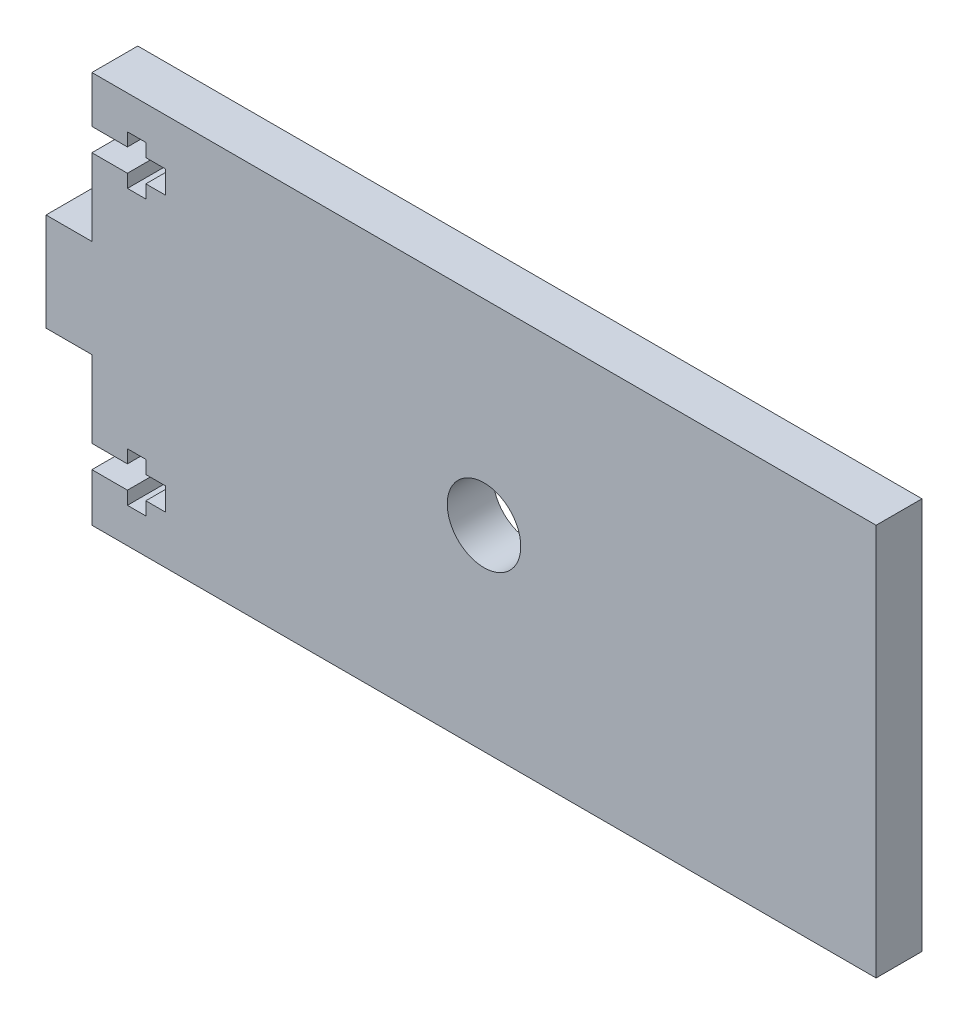
ISO-10303-21;
HEADER;
FILE_DESCRIPTION(('STEP AP214'),'2;1');
FILE_NAME('part.step','',(''),(''),'','','');
FILE_SCHEMA(('AUTOMOTIVE_DESIGN { 1 0 10303 214 1 1 1 1 }'));
ENDSEC;
DATA;
#1=APPLICATION_CONTEXT('core data for automotive mechanical design processes');
#2=APPLICATION_PROTOCOL_DEFINITION('international standard','automotive_design',2000,#1);
#3=PRODUCT_CONTEXT('',#1,'mechanical');
#4=PRODUCT('Part','Part','',(#3));
#5=PRODUCT_RELATED_PRODUCT_CATEGORY('part','',(#4));
#6=PRODUCT_DEFINITION_FORMATION('','',#4);
#7=PRODUCT_DEFINITION_CONTEXT('part definition',#1,'design');
#8=PRODUCT_DEFINITION('design','',#6,#7);
#9=PRODUCT_DEFINITION_SHAPE('','',#8);
#10=(LENGTH_UNIT() NAMED_UNIT(*) SI_UNIT(.MILLI.,.METRE.));
#11=(NAMED_UNIT(*) PLANE_ANGLE_UNIT() SI_UNIT($,.RADIAN.));
#12=(NAMED_UNIT(*) SI_UNIT($,.STERADIAN.) SOLID_ANGLE_UNIT());
#13=UNCERTAINTY_MEASURE_WITH_UNIT(LENGTH_MEASURE(1.E-05),#10,'distance_accuracy_value','');
#14=(GEOMETRIC_REPRESENTATION_CONTEXT(3) GLOBAL_UNCERTAINTY_ASSIGNED_CONTEXT((#13)) GLOBAL_UNIT_ASSIGNED_CONTEXT((#10,
#11,#12)) REPRESENTATION_CONTEXT('',''));
#15=CARTESIAN_POINT('',(0.,0.,0.));
#16=DIRECTION('',(0.,0.,1.));
#17=DIRECTION('',(1.,0.,0.));
#18=AXIS2_PLACEMENT_3D('',#15,#16,#17);
#19=CARTESIAN_POINT('',(0.,0.,5.9436));
#20=DIRECTION('',(1.,0.,0.));
#21=DIRECTION('',(0.,0.,-1.));
#22=AXIS2_PLACEMENT_3D('',#19,#20,#21);
#23=PLANE('',#22);
#24=DIRECTION('',(0.,-1.,0.));
#25=VECTOR('',#24,1.);
#26=CARTESIAN_POINT('',(0.,0.,5.9436));
#27=LINE('',#26,#25);
#28=CARTESIAN_POINT('',(0.,41.798931347115,5.9436));
#29=VERTEX_POINT('',#28);
#30=CARTESIAN_POINT('',(0.,31.842131347115,5.9436));
#31=VERTEX_POINT('',#30);
#32=EDGE_CURVE('E267',#29,#31,#27,.T.);
#33=ORIENTED_EDGE('',*,*,#32,.F.);
#34=DIRECTION('',(0.,0.,-1.));
#35=VECTOR('',#34,1.);
#36=CARTESIAN_POINT('',(0.,41.798931347115,5.9436));
#37=LINE('',#36,#35);
#38=CARTESIAN_POINT('',(0.,41.798931347115,0.));
#39=VERTEX_POINT('',#38);
#40=EDGE_CURVE('E317',#29,#39,#37,.T.);
#41=ORIENTED_EDGE('',*,*,#40,.T.);
#42=DIRECTION('',(0.,-1.,0.));
#43=VECTOR('',#42,1.);
#44=CARTESIAN_POINT('',(0.,0.,0.));
#45=LINE('',#44,#43);
#46=CARTESIAN_POINT('',(0.,31.842131347115,0.));
#47=VERTEX_POINT('',#46);
#48=EDGE_CURVE('E390',#39,#47,#45,.T.);
#49=ORIENTED_EDGE('',*,*,#48,.T.);
#50=DIRECTION('',(0.,0.,-1.));
#51=VECTOR('',#50,1.);
#52=CARTESIAN_POINT('',(0.,31.842131347115,19.9654861197629));
#53=LINE('',#52,#51);
#54=EDGE_CURVE('E311',#31,#47,#53,.T.);
#55=ORIENTED_EDGE('',*,*,#54,.F.);
#56=EDGE_LOOP('',(#33,#41,#49,#55));
#57=FACE_BOUND('',#56,.T.);
#58=ADVANCED_FACE('F32',(#57),#23,.F.);
#59=CARTESIAN_POINT('',(0.,19.142131347115,0.));
#60=VERTEX_POINT('',#59);
#61=CARTESIAN_POINT('',(0.,9.18533134711462,0.));
#62=VERTEX_POINT('',#61);
#63=EDGE_CURVE('E290',#60,#62,#45,.T.);
#64=ORIENTED_EDGE('',*,*,#63,.T.);
#65=DIRECTION('',(0.,0.,-1.));
#66=VECTOR('',#65,1.);
#67=CARTESIAN_POINT('',(0.,9.18533134711462,5.9436));
#68=LINE('',#67,#66);
#69=CARTESIAN_POINT('',(0.,9.18533134711462,5.9436));
#70=VERTEX_POINT('',#69);
#71=EDGE_CURVE('E289',#70,#62,#68,.T.);
#72=ORIENTED_EDGE('',*,*,#71,.F.);
#73=CARTESIAN_POINT('',(0.,19.142131347115,5.9436));
#74=VERTEX_POINT('',#73);
#75=EDGE_CURVE('E270',#74,#70,#27,.T.);
#76=ORIENTED_EDGE('',*,*,#75,.F.);
#77=DIRECTION('',(0.,0.,-1.));
#78=VECTOR('',#77,1.);
#79=CARTESIAN_POINT('',(0.,19.142131347115,19.9654861197629));
#80=LINE('',#79,#78);
#81=EDGE_CURVE('E287',#74,#60,#80,.T.);
#82=ORIENTED_EDGE('',*,*,#81,.T.);
#83=EDGE_LOOP('',(#64,#72,#76,#82));
#84=FACE_BOUND('',#83,.T.);
#85=ADVANCED_FACE('F286',(#84),#23,.F.);
#86=CARTESIAN_POINT('',(0.,50.8,0.));
#87=VERTEX_POINT('',#86);
#88=CARTESIAN_POINT('',(0.,44.745331347115,0.));
#89=VERTEX_POINT('',#88);
#90=EDGE_CURVE('E257',#87,#89,#45,.T.);
#91=ORIENTED_EDGE('',*,*,#90,.T.);
#92=DIRECTION('',(0.,0.,-1.));
#93=VECTOR('',#92,1.);
#94=CARTESIAN_POINT('',(0.,44.745331347115,5.9436));
#95=LINE('',#94,#93);
#96=CARTESIAN_POINT('',(0.,44.745331347115,5.9436));
#97=VERTEX_POINT('',#96);
#98=EDGE_CURVE('E55',#97,#89,#95,.T.);
#99=ORIENTED_EDGE('',*,*,#98,.F.);
#100=CARTESIAN_POINT('',(0.,50.8,5.9436));
#101=VERTEX_POINT('',#100);
#102=EDGE_CURVE('E255',#101,#97,#27,.T.);
#103=ORIENTED_EDGE('',*,*,#102,.F.);
#104=DIRECTION('',(0.,0.,-1.));
#105=VECTOR('',#104,1.);
#106=CARTESIAN_POINT('',(0.,50.8,5.9436));
#107=LINE('',#106,#105);
#108=EDGE_CURVE('E386',#101,#87,#107,.T.);
#109=ORIENTED_EDGE('',*,*,#108,.T.);
#110=EDGE_LOOP('',(#91,#99,#103,#109));
#111=FACE_BOUND('',#110,.T.);
#112=ADVANCED_FACE('F253',(#111),#23,.F.);
#113=CARTESIAN_POINT('',(0.,6.23893134711462,5.9436));
#114=VERTEX_POINT('',#113);
#115=CARTESIAN_POINT('',(0.,0.,5.9436));
#116=VERTEX_POINT('',#115);
#117=EDGE_CURVE('E269',#114,#116,#27,.T.);
#118=ORIENTED_EDGE('',*,*,#117,.F.);
#119=DIRECTION('',(0.,0.,-1.));
#120=VECTOR('',#119,1.);
#121=CARTESIAN_POINT('',(0.,6.23893134711462,5.9436));
#122=LINE('',#121,#120);
#123=CARTESIAN_POINT('',(0.,6.23893134711462,0.));
#124=VERTEX_POINT('',#123);
#125=EDGE_CURVE('E295',#114,#124,#122,.T.);
#126=ORIENTED_EDGE('',*,*,#125,.T.);
#127=CARTESIAN_POINT('',(0.,0.,0.));
#128=VERTEX_POINT('',#127);
#129=EDGE_CURVE('E334',#124,#128,#45,.T.);
#130=ORIENTED_EDGE('',*,*,#129,.T.);
#131=DIRECTION('',(0.,0.,-1.));
#132=VECTOR('',#131,1.);
#133=CARTESIAN_POINT('',(0.,0.,5.9436));
#134=LINE('',#133,#132);
#135=EDGE_CURVE('E11',#116,#128,#134,.T.);
#136=ORIENTED_EDGE('',*,*,#135,.F.);
#137=EDGE_LOOP('',(#118,#126,#130,#136));
#138=FACE_BOUND('',#137,.T.);
#139=ADVANCED_FACE('F34',(#138),#23,.F.);
#140=CARTESIAN_POINT('',(0.,0.,5.9436));
#141=DIRECTION('',(0.,1.,0.));
#142=DIRECTION('',(0.,0.,1.));
#143=AXIS2_PLACEMENT_3D('',#140,#141,#142);
#144=PLANE('',#143);
#145=DIRECTION('',(1.,0.,0.));
#146=VECTOR('',#145,1.);
#147=CARTESIAN_POINT('',(0.,0.,0.));
#148=LINE('',#147,#146);
#149=CARTESIAN_POINT('',(101.6,0.,0.));
#150=VERTEX_POINT('',#149);
#151=EDGE_CURVE('E379',#128,#150,#148,.T.);
#152=ORIENTED_EDGE('',*,*,#151,.T.);
#153=DIRECTION('',(0.,0.,-1.));
#154=VECTOR('',#153,1.);
#155=CARTESIAN_POINT('',(101.6,0.,5.9436));
#156=LINE('',#155,#154);
#157=CARTESIAN_POINT('',(101.6,0.,5.9436));
#158=VERTEX_POINT('',#157);
#159=EDGE_CURVE('E40',#158,#150,#156,.T.);
#160=ORIENTED_EDGE('',*,*,#159,.F.);
#161=DIRECTION('',(1.,0.,0.));
#162=VECTOR('',#161,1.);
#163=CARTESIAN_POINT('',(0.,0.,5.9436));
#164=LINE('',#163,#162);
#165=EDGE_CURVE('E266',#116,#158,#164,.T.);
#166=ORIENTED_EDGE('',*,*,#165,.F.);
#167=ORIENTED_EDGE('',*,*,#135,.T.);
#168=EDGE_LOOP('',(#152,#160,#166,#167));
#169=FACE_BOUND('',#168,.T.);
#170=ADVANCED_FACE('F360',(#169),#144,.F.);
#171=CARTESIAN_POINT('',(101.6,0.,5.9436));
#172=DIRECTION('',(-1.,0.,0.));
#173=DIRECTION('',(0.,0.,1.));
#174=AXIS2_PLACEMENT_3D('',#171,#172,#173);
#175=PLANE('',#174);
#176=DIRECTION('',(0.,1.,0.));
#177=VECTOR('',#176,1.);
#178=CARTESIAN_POINT('',(101.6,0.,0.));
#179=LINE('',#178,#177);
#180=CARTESIAN_POINT('',(101.6,50.8,0.));
#181=VERTEX_POINT('',#180);
#182=EDGE_CURVE('E392',#150,#181,#179,.T.);
#183=ORIENTED_EDGE('',*,*,#182,.T.);
#184=DIRECTION('',(0.,0.,-1.));
#185=VECTOR('',#184,1.);
#186=CARTESIAN_POINT('',(101.6,50.8,5.9436));
#187=LINE('',#186,#185);
#188=CARTESIAN_POINT('',(101.6,50.8,5.9436));
#189=VERTEX_POINT('',#188);
#190=EDGE_CURVE('E382',#189,#181,#187,.T.);
#191=ORIENTED_EDGE('',*,*,#190,.F.);
#192=DIRECTION('',(0.,1.,0.));
#193=VECTOR('',#192,1.);
#194=CARTESIAN_POINT('',(101.6,0.,5.9436));
#195=LINE('',#194,#193);
#196=EDGE_CURVE('E271',#158,#189,#195,.T.);
#197=ORIENTED_EDGE('',*,*,#196,.F.);
#198=ORIENTED_EDGE('',*,*,#159,.T.);
#199=EDGE_LOOP('',(#183,#191,#197,#198));
#200=FACE_BOUND('',#199,.T.);
#201=ADVANCED_FACE('F349',(#200),#175,.F.);
#202=CARTESIAN_POINT('',(0.,50.8,5.9436));
#203=DIRECTION('',(0.,-1.,0.));
#204=DIRECTION('',(0.,0.,-1.));
#205=AXIS2_PLACEMENT_3D('',#202,#203,#204);
#206=PLANE('',#205);
#207=DIRECTION('',(-1.,0.,0.));
#208=VECTOR('',#207,1.);
#209=CARTESIAN_POINT('',(0.,50.8,0.));
#210=LINE('',#209,#208);
#211=EDGE_CURVE('E274',#181,#87,#210,.T.);
#212=ORIENTED_EDGE('',*,*,#211,.T.);
#213=ORIENTED_EDGE('',*,*,#108,.F.);
#214=DIRECTION('',(-1.,0.,0.));
#215=VECTOR('',#214,1.);
#216=CARTESIAN_POINT('',(0.,50.8,5.9436));
#217=LINE('',#216,#215);
#218=EDGE_CURVE('E264',#189,#101,#217,.T.);
#219=ORIENTED_EDGE('',*,*,#218,.F.);
#220=ORIENTED_EDGE('',*,*,#190,.T.);
#221=EDGE_LOOP('',(#212,#213,#219,#220));
#222=FACE_BOUND('',#221,.T.);
#223=ADVANCED_FACE('F341',(#222),#206,.F.);
#224=CARTESIAN_POINT('',(0.,0.,5.9436));
#225=DIRECTION('',(0.,0.,-1.));
#226=DIRECTION('',(-1.,0.,0.));
#227=AXIS2_PLACEMENT_3D('',#224,#225,#226);
#228=PLANE('',#227);
#229=DIRECTION('',(0.,1.,0.));
#230=VECTOR('',#229,1.);
#231=CARTESIAN_POINT('',(4.60401,41.7989313471151,5.9436));
#232=LINE('',#231,#230);
#233=CARTESIAN_POINT('',(4.60401,40.0971313471151,5.9436));
#234=VERTEX_POINT('',#233);
#235=CARTESIAN_POINT('',(4.60401,41.7989313471151,5.9436));
#236=VERTEX_POINT('',#235);
#237=EDGE_CURVE('E575',#234,#236,#232,.T.);
#238=ORIENTED_EDGE('',*,*,#237,.T.);
#239=DIRECTION('',(-1.,0.,0.));
#240=VECTOR('',#239,1.);
#241=CARTESIAN_POINT('',(0.,41.798931347115,5.9436));
#242=LINE('',#241,#240);
#243=EDGE_CURVE('E258',#236,#29,#242,.T.);
#244=ORIENTED_EDGE('',*,*,#243,.T.);
#245=ORIENTED_EDGE('',*,*,#32,.T.);
#246=DIRECTION('',(-1.,0.,0.));
#247=VECTOR('',#246,1.);
#248=CARTESIAN_POINT('',(-5.94334,31.8421313471151,5.9436));
#249=LINE('',#248,#247);
#250=CARTESIAN_POINT('',(-5.94334,31.8421313471151,5.9436));
#251=VERTEX_POINT('',#250);
#252=EDGE_CURVE('E310',#31,#251,#249,.T.);
#253=ORIENTED_EDGE('',*,*,#252,.T.);
#254=DIRECTION('',(0.,-1.,0.));
#255=VECTOR('',#254,1.);
#256=CARTESIAN_POINT('',(-5.94333999999999,19.1421313471151,5.9436));
#257=LINE('',#256,#255);
#258=CARTESIAN_POINT('',(-5.94333999999999,19.1421313471151,5.9436));
#259=VERTEX_POINT('',#258);
#260=EDGE_CURVE('E308',#251,#259,#257,.T.);
#261=ORIENTED_EDGE('',*,*,#260,.T.);
#262=DIRECTION('',(1.,0.,0.));
#263=VECTOR('',#262,1.);
#264=CARTESIAN_POINT('',(0.,19.142131347115,5.9436));
#265=LINE('',#264,#263);
#266=EDGE_CURVE('E281',#259,#74,#265,.T.);
#267=ORIENTED_EDGE('',*,*,#266,.T.);
#268=ORIENTED_EDGE('',*,*,#75,.T.);
#269=DIRECTION('',(1.,0.,0.));
#270=VECTOR('',#269,1.);
#271=CARTESIAN_POINT('',(0.,9.18533134711462,5.9436));
#272=LINE('',#271,#270);
#273=CARTESIAN_POINT('',(4.60401,9.18533134711506,5.9436));
#274=VERTEX_POINT('',#273);
#275=EDGE_CURVE('E279',#70,#274,#272,.T.);
#276=ORIENTED_EDGE('',*,*,#275,.T.);
#277=DIRECTION('',(0.,1.,0.));
#278=VECTOR('',#277,1.);
#279=CARTESIAN_POINT('',(4.60401,9.18533134711506,5.9436));
#280=LINE('',#279,#278);
#281=CARTESIAN_POINT('',(4.60401,10.887131347115,5.9436));
#282=VERTEX_POINT('',#281);
#283=EDGE_CURVE('E466',#274,#282,#280,.T.);
#284=ORIENTED_EDGE('',*,*,#283,.T.);
#285=DIRECTION('',(1.,0.,0.));
#286=VECTOR('',#285,1.);
#287=CARTESIAN_POINT('',(4.60401,10.887131347115,5.9436));
#288=LINE('',#287,#286);
#289=CARTESIAN_POINT('',(6.98526,10.887131347115,5.9436));
#290=VERTEX_POINT('',#289);
#291=EDGE_CURVE('E468',#282,#290,#288,.T.);
#292=ORIENTED_EDGE('',*,*,#291,.T.);
#293=DIRECTION('',(0.,-1.,0.));
#294=VECTOR('',#293,1.);
#295=CARTESIAN_POINT('',(6.98526,10.887131347115,5.9436));
#296=LINE('',#295,#294);
#297=CARTESIAN_POINT('',(6.98526,9.18533134711506,5.9436));
#298=VERTEX_POINT('',#297);
#299=EDGE_CURVE('E471',#290,#298,#296,.T.);
#300=ORIENTED_EDGE('',*,*,#299,.T.);
#301=DIRECTION('',(1.,0.,0.));
#302=VECTOR('',#301,1.);
#303=CARTESIAN_POINT('',(6.98526,9.18533134711506,5.9436));
#304=LINE('',#303,#302);
#305=CARTESIAN_POINT('',(9.52526,9.18533134711505,5.9436));
#306=VERTEX_POINT('',#305);
#307=EDGE_CURVE('E474',#298,#306,#304,.T.);
#308=ORIENTED_EDGE('',*,*,#307,.T.);
#309=DIRECTION('',(0.,-1.,0.));
#310=VECTOR('',#309,1.);
#311=CARTESIAN_POINT('',(9.52526,9.18533134711505,5.9436));
#312=LINE('',#311,#310);
#313=CARTESIAN_POINT('',(9.52526,6.23893134711505,5.9436));
#314=VERTEX_POINT('',#313);
#315=EDGE_CURVE('E477',#306,#314,#312,.T.);
#316=ORIENTED_EDGE('',*,*,#315,.T.);
#317=DIRECTION('',(-1.,0.,0.));
#318=VECTOR('',#317,1.);
#319=CARTESIAN_POINT('',(9.52526,6.23893134711505,5.9436));
#320=LINE('',#319,#318);
#321=CARTESIAN_POINT('',(6.98526,6.23893134711505,5.9436));
#322=VERTEX_POINT('',#321);
#323=EDGE_CURVE('E480',#314,#322,#320,.T.);
#324=ORIENTED_EDGE('',*,*,#323,.T.);
#325=DIRECTION('',(0.,-1.,0.));
#326=VECTOR('',#325,1.);
#327=CARTESIAN_POINT('',(6.98526,6.23893134711505,5.9436));
#328=LINE('',#327,#326);
#329=CARTESIAN_POINT('',(6.98526,4.53713134711506,5.9436));
#330=VERTEX_POINT('',#329);
#331=EDGE_CURVE('E307',#322,#330,#328,.T.);
#332=ORIENTED_EDGE('',*,*,#331,.T.);
#333=DIRECTION('',(-1.,0.,0.));
#334=VECTOR('',#333,1.);
#335=CARTESIAN_POINT('',(6.98526,4.53713134711506,5.9436));
#336=LINE('',#335,#334);
#337=CARTESIAN_POINT('',(4.60401,4.53713134711506,5.9436));
#338=VERTEX_POINT('',#337);
#339=EDGE_CURVE('E458',#330,#338,#336,.T.);
#340=ORIENTED_EDGE('',*,*,#339,.T.);
#341=DIRECTION('',(0.,1.,0.));
#342=VECTOR('',#341,1.);
#343=CARTESIAN_POINT('',(4.60401,4.53713134711506,5.9436));
#344=LINE('',#343,#342);
#345=CARTESIAN_POINT('',(4.60401,6.23893134711505,5.9436));
#346=VERTEX_POINT('',#345);
#347=EDGE_CURVE('E461',#338,#346,#344,.T.);
#348=ORIENTED_EDGE('',*,*,#347,.T.);
#349=DIRECTION('',(-1.,0.,0.));
#350=VECTOR('',#349,1.);
#351=CARTESIAN_POINT('',(4.60401,6.23893134711505,5.9436));
#352=LINE('',#351,#350);
#353=EDGE_CURVE('E375',#346,#114,#352,.T.);
#354=ORIENTED_EDGE('',*,*,#353,.T.);
#355=ORIENTED_EDGE('',*,*,#117,.T.);
#356=ORIENTED_EDGE('',*,*,#165,.T.);
#357=ORIENTED_EDGE('',*,*,#196,.T.);
#358=ORIENTED_EDGE('',*,*,#218,.T.);
#359=ORIENTED_EDGE('',*,*,#102,.T.);
#360=DIRECTION('',(1.,0.,0.));
#361=VECTOR('',#360,1.);
#362=CARTESIAN_POINT('',(4.60401,44.745331347115,5.9436));
#363=LINE('',#362,#361);
#364=CARTESIAN_POINT('',(4.60401,44.745331347115,5.9436));
#365=VERTEX_POINT('',#364);
#366=EDGE_CURVE('E240',#97,#365,#363,.T.);
#367=ORIENTED_EDGE('',*,*,#366,.T.);
#368=DIRECTION('',(0.,1.,0.));
#369=VECTOR('',#368,1.);
#370=CARTESIAN_POINT('',(4.60401,46.447131347115,5.9436));
#371=LINE('',#370,#369);
#372=CARTESIAN_POINT('',(4.60401,46.447131347115,5.9436));
#373=VERTEX_POINT('',#372);
#374=EDGE_CURVE('E247',#365,#373,#371,.T.);
#375=ORIENTED_EDGE('',*,*,#374,.T.);
#376=DIRECTION('',(1.,0.,0.));
#377=VECTOR('',#376,1.);
#378=CARTESIAN_POINT('',(6.98526,46.447131347115,5.9436));
#379=LINE('',#378,#377);
#380=CARTESIAN_POINT('',(6.98526,46.447131347115,5.9436));
#381=VERTEX_POINT('',#380);
#382=EDGE_CURVE('E595',#373,#381,#379,.T.);
#383=ORIENTED_EDGE('',*,*,#382,.T.);
#384=DIRECTION('',(0.,-1.,0.));
#385=VECTOR('',#384,1.);
#386=CARTESIAN_POINT('',(6.98526,44.745331347115,5.9436));
#387=LINE('',#386,#385);
#388=CARTESIAN_POINT('',(6.98526,44.745331347115,5.9436));
#389=VERTEX_POINT('',#388);
#390=EDGE_CURVE('E592',#381,#389,#387,.T.);
#391=ORIENTED_EDGE('',*,*,#390,.T.);
#392=DIRECTION('',(1.,0.,0.));
#393=VECTOR('',#392,1.);
#394=CARTESIAN_POINT('',(9.52526,44.745331347115,5.9436));
#395=LINE('',#394,#393);
#396=CARTESIAN_POINT('',(9.52526,44.745331347115,5.9436));
#397=VERTEX_POINT('',#396);
#398=EDGE_CURVE('E589',#389,#397,#395,.T.);
#399=ORIENTED_EDGE('',*,*,#398,.T.);
#400=DIRECTION('',(0.,-1.,0.));
#401=VECTOR('',#400,1.);
#402=CARTESIAN_POINT('',(9.52526,41.7989313471151,5.9436));
#403=LINE('',#402,#401);
#404=CARTESIAN_POINT('',(9.52526,41.7989313471151,5.9436));
#405=VERTEX_POINT('',#404);
#406=EDGE_CURVE('E586',#397,#405,#403,.T.);
#407=ORIENTED_EDGE('',*,*,#406,.T.);
#408=DIRECTION('',(-1.,0.,0.));
#409=VECTOR('',#408,1.);
#410=CARTESIAN_POINT('',(6.98526,41.7989313471151,5.9436));
#411=LINE('',#410,#409);
#412=CARTESIAN_POINT('',(6.98526,41.7989313471151,5.9436));
#413=VERTEX_POINT('',#412);
#414=EDGE_CURVE('E583',#405,#413,#411,.T.);
#415=ORIENTED_EDGE('',*,*,#414,.T.);
#416=DIRECTION('',(0.,-1.,0.));
#417=VECTOR('',#416,1.);
#418=CARTESIAN_POINT('',(6.98526,40.0971313471151,5.9436));
#419=LINE('',#418,#417);
#420=CARTESIAN_POINT('',(6.98526,40.0971313471151,5.9436));
#421=VERTEX_POINT('',#420);
#422=EDGE_CURVE('E578',#413,#421,#419,.T.);
#423=ORIENTED_EDGE('',*,*,#422,.T.);
#424=DIRECTION('',(-1.,0.,0.));
#425=VECTOR('',#424,1.);
#426=CARTESIAN_POINT('',(4.60401,40.0971313471151,5.9436));
#427=LINE('',#426,#425);
#428=EDGE_CURVE('E577',#421,#234,#427,.T.);
#429=ORIENTED_EDGE('',*,*,#428,.T.);
#430=EDGE_LOOP('',(#238,#244,#245,#253,#261,#267,#268,#276,#284,#292,#300,#308,#316,#324,#332,
#340,#348,#354,#355,#356,#357,#358,#359,#367,#375,#383,#391,#399,#407,#415,#423,#429));
#431=FACE_BOUND('',#430,.T.);
#432=CARTESIAN_POINT('',(50.8,25.4,5.9436));
#433=DIRECTION('',(0.,0.,1.));
#434=DIRECTION('',(1.,0.,0.));
#435=AXIS2_PLACEMENT_3D('',#432,#433,#434);
#436=CIRCLE('',#435,4.7625);
#437=CARTESIAN_POINT('',(55.5625,25.4,5.9436));
#438=VERTEX_POINT('',#437);
#439=EDGE_CURVE('E331',#438,#438,#436,.T.);
#440=ORIENTED_EDGE('',*,*,#439,.F.);
#441=EDGE_LOOP('',(#440));
#442=FACE_BOUND('',#441,.T.);
#443=ADVANCED_FACE('F261',(#431,#442),#228,.F.);
#444=CARTESIAN_POINT('',(0.,0.,0.));
#445=DIRECTION('',(0.,0.,-1.));
#446=DIRECTION('',(-1.,0.,0.));
#447=AXIS2_PLACEMENT_3D('',#444,#445,#446);
#448=PLANE('',#447);
#449=DIRECTION('',(-1.,0.,0.));
#450=VECTOR('',#449,1.);
#451=CARTESIAN_POINT('',(0.,41.798931347115,0.));
#452=LINE('',#451,#450);
#453=CARTESIAN_POINT('',(4.60401,41.7989313471151,0.));
#454=VERTEX_POINT('',#453);
#455=EDGE_CURVE('E248',#454,#39,#452,.T.);
#456=ORIENTED_EDGE('',*,*,#455,.F.);
#457=DIRECTION('',(0.,1.,0.));
#458=VECTOR('',#457,1.);
#459=CARTESIAN_POINT('',(4.60401,41.7989313471151,0.));
#460=LINE('',#459,#458);
#461=CARTESIAN_POINT('',(4.60401,40.0971313471151,0.));
#462=VERTEX_POINT('',#461);
#463=EDGE_CURVE('E433',#462,#454,#460,.T.);
#464=ORIENTED_EDGE('',*,*,#463,.F.);
#465=DIRECTION('',(-1.,0.,0.));
#466=VECTOR('',#465,1.);
#467=CARTESIAN_POINT('',(4.60401,40.0971313471151,0.));
#468=LINE('',#467,#466);
#469=CARTESIAN_POINT('',(6.98526,40.0971313471151,0.));
#470=VERTEX_POINT('',#469);
#471=EDGE_CURVE('E430',#470,#462,#468,.T.);
#472=ORIENTED_EDGE('',*,*,#471,.F.);
#473=DIRECTION('',(0.,-1.,0.));
#474=VECTOR('',#473,1.);
#475=CARTESIAN_POINT('',(6.98526,40.0971313471151,0.));
#476=LINE('',#475,#474);
#477=CARTESIAN_POINT('',(6.98526,41.7989313471151,0.));
#478=VERTEX_POINT('',#477);
#479=EDGE_CURVE('E427',#478,#470,#476,.T.);
#480=ORIENTED_EDGE('',*,*,#479,.F.);
#481=DIRECTION('',(-1.,0.,0.));
#482=VECTOR('',#481,1.);
#483=CARTESIAN_POINT('',(6.98526,41.7989313471151,0.));
#484=LINE('',#483,#482);
#485=CARTESIAN_POINT('',(9.52526,41.7989313471151,0.));
#486=VERTEX_POINT('',#485);
#487=EDGE_CURVE('E424',#486,#478,#484,.T.);
#488=ORIENTED_EDGE('',*,*,#487,.F.);
#489=DIRECTION('',(0.,-1.,0.));
#490=VECTOR('',#489,1.);
#491=CARTESIAN_POINT('',(9.52526,41.7989313471151,0.));
#492=LINE('',#491,#490);
#493=CARTESIAN_POINT('',(9.52526,44.745331347115,0.));
#494=VERTEX_POINT('',#493);
#495=EDGE_CURVE('E421',#494,#486,#492,.T.);
#496=ORIENTED_EDGE('',*,*,#495,.F.);
#497=DIRECTION('',(1.,0.,0.));
#498=VECTOR('',#497,1.);
#499=CARTESIAN_POINT('',(9.52526,44.745331347115,0.));
#500=LINE('',#499,#498);
#501=CARTESIAN_POINT('',(6.98526,44.745331347115,0.));
#502=VERTEX_POINT('',#501);
#503=EDGE_CURVE('E418',#502,#494,#500,.T.);
#504=ORIENTED_EDGE('',*,*,#503,.F.);
#505=DIRECTION('',(0.,-1.,0.));
#506=VECTOR('',#505,1.);
#507=CARTESIAN_POINT('',(6.98526,44.745331347115,0.));
#508=LINE('',#507,#506);
#509=CARTESIAN_POINT('',(6.98526,46.447131347115,0.));
#510=VERTEX_POINT('',#509);
#511=EDGE_CURVE('E415',#510,#502,#508,.T.);
#512=ORIENTED_EDGE('',*,*,#511,.F.);
#513=DIRECTION('',(1.,0.,0.));
#514=VECTOR('',#513,1.);
#515=CARTESIAN_POINT('',(6.98526,46.447131347115,0.));
#516=LINE('',#515,#514);
#517=CARTESIAN_POINT('',(4.60401,46.447131347115,0.));
#518=VERTEX_POINT('',#517);
#519=EDGE_CURVE('E406',#518,#510,#516,.T.);
#520=ORIENTED_EDGE('',*,*,#519,.F.);
#521=DIRECTION('',(0.,1.,0.));
#522=VECTOR('',#521,1.);
#523=CARTESIAN_POINT('',(4.60401,46.447131347115,0.));
#524=LINE('',#523,#522);
#525=CARTESIAN_POINT('',(4.60401,44.745331347115,0.));
#526=VERTEX_POINT('',#525);
#527=EDGE_CURVE('E403',#526,#518,#524,.T.);
#528=ORIENTED_EDGE('',*,*,#527,.F.);
#529=DIRECTION('',(1.,0.,0.));
#530=VECTOR('',#529,1.);
#531=CARTESIAN_POINT('',(4.60401,44.745331347115,0.));
#532=LINE('',#531,#530);
#533=EDGE_CURVE('E400',#89,#526,#532,.T.);
#534=ORIENTED_EDGE('',*,*,#533,.F.);
#535=ORIENTED_EDGE('',*,*,#90,.F.);
#536=ORIENTED_EDGE('',*,*,#211,.F.);
#537=ORIENTED_EDGE('',*,*,#182,.F.);
#538=ORIENTED_EDGE('',*,*,#151,.F.);
#539=ORIENTED_EDGE('',*,*,#129,.F.);
#540=DIRECTION('',(-1.,0.,0.));
#541=VECTOR('',#540,1.);
#542=CARTESIAN_POINT('',(4.60401,6.23893134711505,0.));
#543=LINE('',#542,#541);
#544=CARTESIAN_POINT('',(4.60401,6.23893134711505,0.));
#545=VERTEX_POINT('',#544);
#546=EDGE_CURVE('E489',#545,#124,#543,.T.);
#547=ORIENTED_EDGE('',*,*,#546,.F.);
#548=DIRECTION('',(0.,1.,0.));
#549=VECTOR('',#548,1.);
#550=CARTESIAN_POINT('',(4.60401,4.53713134711506,0.));
#551=LINE('',#550,#549);
#552=CARTESIAN_POINT('',(4.60401,4.53713134711506,0.));
#553=VERTEX_POINT('',#552);
#554=EDGE_CURVE('E486',#553,#545,#551,.T.);
#555=ORIENTED_EDGE('',*,*,#554,.F.);
#556=DIRECTION('',(-1.,0.,0.));
#557=VECTOR('',#556,1.);
#558=CARTESIAN_POINT('',(6.98526,4.53713134711506,0.));
#559=LINE('',#558,#557);
#560=CARTESIAN_POINT('',(6.98526,4.53713134711506,0.));
#561=VERTEX_POINT('',#560);
#562=EDGE_CURVE('E47',#561,#553,#559,.T.);
#563=ORIENTED_EDGE('',*,*,#562,.F.);
#564=DIRECTION('',(0.,-1.,0.));
#565=VECTOR('',#564,1.);
#566=CARTESIAN_POINT('',(6.98526,6.23893134711505,0.));
#567=LINE('',#566,#565);
#568=CARTESIAN_POINT('',(6.98526,6.23893134711505,0.));
#569=VERTEX_POINT('',#568);
#570=EDGE_CURVE('E462',#569,#561,#567,.T.);
#571=ORIENTED_EDGE('',*,*,#570,.F.);
#572=DIRECTION('',(-1.,0.,0.));
#573=VECTOR('',#572,1.);
#574=CARTESIAN_POINT('',(9.52526,6.23893134711505,0.));
#575=LINE('',#574,#573);
#576=CARTESIAN_POINT('',(9.52526,6.23893134711505,0.));
#577=VERTEX_POINT('',#576);
#578=EDGE_CURVE('E508',#577,#569,#575,.T.);
#579=ORIENTED_EDGE('',*,*,#578,.F.);
#580=DIRECTION('',(0.,-1.,0.));
#581=VECTOR('',#580,1.);
#582=CARTESIAN_POINT('',(9.52526,9.18533134711505,0.));
#583=LINE('',#582,#581);
#584=CARTESIAN_POINT('',(9.52526,9.18533134711505,0.));
#585=VERTEX_POINT('',#584);
#586=EDGE_CURVE('E505',#585,#577,#583,.T.);
#587=ORIENTED_EDGE('',*,*,#586,.F.);
#588=DIRECTION('',(1.,0.,0.));
#589=VECTOR('',#588,1.);
#590=CARTESIAN_POINT('',(6.98526,9.18533134711506,0.));
#591=LINE('',#590,#589);
#592=CARTESIAN_POINT('',(6.98526,9.18533134711506,0.));
#593=VERTEX_POINT('',#592);
#594=EDGE_CURVE('E502',#593,#585,#591,.T.);
#595=ORIENTED_EDGE('',*,*,#594,.F.);
#596=DIRECTION('',(0.,-1.,0.));
#597=VECTOR('',#596,1.);
#598=CARTESIAN_POINT('',(6.98526,10.887131347115,0.));
#599=LINE('',#598,#597);
#600=CARTESIAN_POINT('',(6.98526,10.887131347115,0.));
#601=VERTEX_POINT('',#600);
#602=EDGE_CURVE('E499',#601,#593,#599,.T.);
#603=ORIENTED_EDGE('',*,*,#602,.F.);
#604=DIRECTION('',(1.,0.,0.));
#605=VECTOR('',#604,1.);
#606=CARTESIAN_POINT('',(4.60401,10.887131347115,0.));
#607=LINE('',#606,#605);
#608=CARTESIAN_POINT('',(4.60401,10.887131347115,0.));
#609=VERTEX_POINT('',#608);
#610=EDGE_CURVE('E496',#609,#601,#607,.T.);
#611=ORIENTED_EDGE('',*,*,#610,.F.);
#612=DIRECTION('',(0.,1.,0.));
#613=VECTOR('',#612,1.);
#614=CARTESIAN_POINT('',(4.60401,9.18533134711506,0.));
#615=LINE('',#614,#613);
#616=CARTESIAN_POINT('',(4.60401,9.18533134711506,0.));
#617=VERTEX_POINT('',#616);
#618=EDGE_CURVE('E493',#617,#609,#615,.T.);
#619=ORIENTED_EDGE('',*,*,#618,.F.);
#620=DIRECTION('',(1.,0.,0.));
#621=VECTOR('',#620,1.);
#622=CARTESIAN_POINT('',(0.,9.18533134711462,0.));
#623=LINE('',#622,#621);
#624=EDGE_CURVE('E491',#62,#617,#623,.T.);
#625=ORIENTED_EDGE('',*,*,#624,.F.);
#626=ORIENTED_EDGE('',*,*,#63,.F.);
#627=DIRECTION('',(-1.,0.,0.));
#628=VECTOR('',#627,1.);
#629=CARTESIAN_POINT('',(0.,19.142131347115,0.));
#630=LINE('',#629,#628);
#631=CARTESIAN_POINT('',(-5.94333999999999,19.1421313471151,0.));
#632=VERTEX_POINT('',#631);
#633=EDGE_CURVE('E313',#60,#632,#630,.T.);
#634=ORIENTED_EDGE('',*,*,#633,.T.);
#635=DIRECTION('',(0.,1.,0.));
#636=VECTOR('',#635,1.);
#637=CARTESIAN_POINT('',(-5.94333999999999,19.1421313471151,0.));
#638=LINE('',#637,#636);
#639=CARTESIAN_POINT('',(-5.94334,31.8421313471151,0.));
#640=VERTEX_POINT('',#639);
#641=EDGE_CURVE('E316',#632,#640,#638,.T.);
#642=ORIENTED_EDGE('',*,*,#641,.T.);
#643=DIRECTION('',(1.,0.,0.));
#644=VECTOR('',#643,1.);
#645=CARTESIAN_POINT('',(-5.94334,31.8421313471151,0.));
#646=LINE('',#645,#644);
#647=EDGE_CURVE('E320',#640,#47,#646,.T.);
#648=ORIENTED_EDGE('',*,*,#647,.T.);
#649=ORIENTED_EDGE('',*,*,#48,.F.);
#650=EDGE_LOOP('',(#456,#464,#472,#480,#488,#496,#504,#512,#520,#528,#534,#535,#536,#537,#538,
#539,#547,#555,#563,#571,#579,#587,#595,#603,#611,#619,#625,#626,#634,#642,#648,#649));
#651=FACE_BOUND('',#650,.T.);
#652=CARTESIAN_POINT('',(50.8,25.4,0.));
#653=DIRECTION('',(0.,0.,1.));
#654=DIRECTION('',(1.,0.,0.));
#655=AXIS2_PLACEMENT_3D('',#652,#653,#654);
#656=CIRCLE('',#655,4.7625);
#657=CARTESIAN_POINT('',(55.5625,25.4,0.));
#658=VERTEX_POINT('',#657);
#659=EDGE_CURVE('E332',#658,#658,#656,.T.);
#660=ORIENTED_EDGE('',*,*,#659,.T.);
#661=EDGE_LOOP('',(#660));
#662=FACE_BOUND('',#661,.T.);
#663=ADVANCED_FACE('F340',(#651,#662),#448,.T.);
#664=CARTESIAN_POINT('',(50.8,25.4,0.));
#665=DIRECTION('',(0.,0.,1.));
#666=DIRECTION('',(1.,0.,0.));
#667=AXIS2_PLACEMENT_3D('',#664,#665,#666);
#668=CYLINDRICAL_SURFACE('',#667,4.7625);
#669=ORIENTED_EDGE('',*,*,#659,.F.);
#670=EDGE_LOOP('',(#669));
#671=FACE_BOUND('',#670,.T.);
#672=ORIENTED_EDGE('',*,*,#439,.T.);
#673=EDGE_LOOP('',(#672));
#674=FACE_BOUND('',#673,.T.);
#675=ADVANCED_FACE('F338',(#671,#674),#668,.F.);
#676=CARTESIAN_POINT('',(-5.94334,31.8421313471151,19.9654861197629));
#677=DIRECTION('',(0.,1.,0.));
#678=DIRECTION('',(-1.,0.,0.));
#679=AXIS2_PLACEMENT_3D('',#676,#677,#678);
#680=PLANE('',#679);
#681=ORIENTED_EDGE('',*,*,#252,.F.);
#682=ORIENTED_EDGE('',*,*,#54,.T.);
#683=ORIENTED_EDGE('',*,*,#647,.F.);
#684=DIRECTION('',(0.,0.,-1.));
#685=VECTOR('',#684,1.);
#686=CARTESIAN_POINT('',(-5.94334,31.8421313471151,19.9654861197629));
#687=LINE('',#686,#685);
#688=EDGE_CURVE('E325',#251,#640,#687,.T.);
#689=ORIENTED_EDGE('',*,*,#688,.F.);
#690=EDGE_LOOP('',(#681,#682,#683,#689));
#691=FACE_BOUND('',#690,.T.);
#692=ADVANCED_FACE('F563',(#691),#680,.T.);
#693=CARTESIAN_POINT('',(-5.94333999999999,19.1421313471151,19.9654861197629));
#694=DIRECTION('',(-1.,0.,0.));
#695=DIRECTION('',(0.,-1.,0.));
#696=AXIS2_PLACEMENT_3D('',#693,#694,#695);
#697=PLANE('',#696);
#698=ORIENTED_EDGE('',*,*,#260,.F.);
#699=ORIENTED_EDGE('',*,*,#688,.T.);
#700=ORIENTED_EDGE('',*,*,#641,.F.);
#701=DIRECTION('',(0.,0.,-1.));
#702=VECTOR('',#701,1.);
#703=CARTESIAN_POINT('',(-5.94333999999999,19.1421313471151,19.9654861197629));
#704=LINE('',#703,#702);
#705=EDGE_CURVE('E327',#259,#632,#704,.T.);
#706=ORIENTED_EDGE('',*,*,#705,.F.);
#707=EDGE_LOOP('',(#698,#699,#700,#706));
#708=FACE_BOUND('',#707,.T.);
#709=ADVANCED_FACE('F570',(#708),#697,.T.);
#710=CARTESIAN_POINT('',(0.,19.142131347115,19.9654861197629));
#711=DIRECTION('',(0.,-1.,0.));
#712=DIRECTION('',(1.,0.,0.));
#713=AXIS2_PLACEMENT_3D('',#710,#711,#712);
#714=PLANE('',#713);
#715=ORIENTED_EDGE('',*,*,#266,.F.);
#716=ORIENTED_EDGE('',*,*,#705,.T.);
#717=ORIENTED_EDGE('',*,*,#633,.F.);
#718=ORIENTED_EDGE('',*,*,#81,.F.);
#719=EDGE_LOOP('',(#715,#716,#717,#718));
#720=FACE_BOUND('',#719,.T.);
#721=ADVANCED_FACE('F679',(#720),#714,.T.);
#722=CARTESIAN_POINT('',(6.98526,4.53713134711506,5.9436));
#723=DIRECTION('',(0.,-1.,0.));
#724=DIRECTION('',(0.,0.,-1.));
#725=AXIS2_PLACEMENT_3D('',#722,#723,#724);
#726=PLANE('',#725);
#727=ORIENTED_EDGE('',*,*,#562,.T.);
#728=DIRECTION('',(0.,0.,-1.));
#729=VECTOR('',#728,1.);
#730=CARTESIAN_POINT('',(4.60401,4.53713134711506,5.9436));
#731=LINE('',#730,#729);
#732=EDGE_CURVE('E305',#338,#553,#731,.T.);
#733=ORIENTED_EDGE('',*,*,#732,.F.);
#734=ORIENTED_EDGE('',*,*,#339,.F.);
#735=DIRECTION('',(0.,0.,-1.));
#736=VECTOR('',#735,1.);
#737=CARTESIAN_POINT('',(6.98526,4.53713134711506,5.9436));
#738=LINE('',#737,#736);
#739=EDGE_CURVE('E404',#330,#561,#738,.T.);
#740=ORIENTED_EDGE('',*,*,#739,.T.);
#741=EDGE_LOOP('',(#727,#733,#734,#740));
#742=FACE_BOUND('',#741,.T.);
#743=ADVANCED_FACE('F550',(#742),#726,.F.);
#744=CARTESIAN_POINT('',(6.98526,6.23893134711505,5.9436));
#745=DIRECTION('',(1.,0.,0.));
#746=DIRECTION('',(0.,1.,0.));
#747=AXIS2_PLACEMENT_3D('',#744,#745,#746);
#748=PLANE('',#747);
#749=ORIENTED_EDGE('',*,*,#570,.T.);
#750=ORIENTED_EDGE('',*,*,#739,.F.);
#751=ORIENTED_EDGE('',*,*,#331,.F.);
#752=DIRECTION('',(0.,0.,-1.));
#753=VECTOR('',#752,1.);
#754=CARTESIAN_POINT('',(6.98526,6.23893134711505,5.9436));
#755=LINE('',#754,#753);
#756=EDGE_CURVE('E408',#322,#569,#755,.T.);
#757=ORIENTED_EDGE('',*,*,#756,.T.);
#758=EDGE_LOOP('',(#749,#750,#751,#757));
#759=FACE_BOUND('',#758,.T.);
#760=ADVANCED_FACE('F548',(#759),#748,.F.);
#761=CARTESIAN_POINT('',(9.52526,6.23893134711505,5.9436));
#762=DIRECTION('',(0.,-1.,0.));
#763=DIRECTION('',(1.,0.,0.));
#764=AXIS2_PLACEMENT_3D('',#761,#762,#763);
#765=PLANE('',#764);
#766=ORIENTED_EDGE('',*,*,#578,.T.);
#767=ORIENTED_EDGE('',*,*,#756,.F.);
#768=ORIENTED_EDGE('',*,*,#323,.F.);
#769=DIRECTION('',(0.,0.,-1.));
#770=VECTOR('',#769,1.);
#771=CARTESIAN_POINT('',(9.52526,6.23893134711505,5.9436));
#772=LINE('',#771,#770);
#773=EDGE_CURVE('E514',#314,#577,#772,.T.);
#774=ORIENTED_EDGE('',*,*,#773,.T.);
#775=EDGE_LOOP('',(#766,#767,#768,#774));
#776=FACE_BOUND('',#775,.T.);
#777=ADVANCED_FACE('F544',(#776),#765,.F.);
#778=CARTESIAN_POINT('',(9.52526,9.18533134711505,5.9436));
#779=DIRECTION('',(1.,0.,0.));
#780=DIRECTION('',(0.,1.,0.));
#781=AXIS2_PLACEMENT_3D('',#778,#779,#780);
#782=PLANE('',#781);
#783=ORIENTED_EDGE('',*,*,#586,.T.);
#784=ORIENTED_EDGE('',*,*,#773,.F.);
#785=ORIENTED_EDGE('',*,*,#315,.F.);
#786=DIRECTION('',(0.,0.,-1.));
#787=VECTOR('',#786,1.);
#788=CARTESIAN_POINT('',(9.52526,9.18533134711505,5.9436));
#789=LINE('',#788,#787);
#790=EDGE_CURVE('E516',#306,#585,#789,.T.);
#791=ORIENTED_EDGE('',*,*,#790,.T.);
#792=EDGE_LOOP('',(#783,#784,#785,#791));
#793=FACE_BOUND('',#792,.T.);
#794=ADVANCED_FACE('F540',(#793),#782,.F.);
#795=CARTESIAN_POINT('',(6.98526,9.18533134711506,5.9436));
#796=DIRECTION('',(0.,1.,0.));
#797=DIRECTION('',(-1.,0.,0.));
#798=AXIS2_PLACEMENT_3D('',#795,#796,#797);
#799=PLANE('',#798);
#800=ORIENTED_EDGE('',*,*,#594,.T.);
#801=ORIENTED_EDGE('',*,*,#790,.F.);
#802=ORIENTED_EDGE('',*,*,#307,.F.);
#803=DIRECTION('',(0.,0.,-1.));
#804=VECTOR('',#803,1.);
#805=CARTESIAN_POINT('',(6.98526,9.18533134711506,5.9436));
#806=LINE('',#805,#804);
#807=EDGE_CURVE('E518',#298,#593,#806,.T.);
#808=ORIENTED_EDGE('',*,*,#807,.T.);
#809=EDGE_LOOP('',(#800,#801,#802,#808));
#810=FACE_BOUND('',#809,.T.);
#811=ADVANCED_FACE('F538',(#810),#799,.F.);
#812=CARTESIAN_POINT('',(6.98526,10.887131347115,5.9436));
#813=DIRECTION('',(1.,0.,0.));
#814=DIRECTION('',(0.,1.,0.));
#815=AXIS2_PLACEMENT_3D('',#812,#813,#814);
#816=PLANE('',#815);
#817=ORIENTED_EDGE('',*,*,#602,.T.);
#818=ORIENTED_EDGE('',*,*,#807,.F.);
#819=ORIENTED_EDGE('',*,*,#299,.F.);
#820=DIRECTION('',(0.,0.,-1.));
#821=VECTOR('',#820,1.);
#822=CARTESIAN_POINT('',(6.98526,10.887131347115,5.9436));
#823=LINE('',#822,#821);
#824=EDGE_CURVE('E520',#290,#601,#823,.T.);
#825=ORIENTED_EDGE('',*,*,#824,.T.);
#826=EDGE_LOOP('',(#817,#818,#819,#825));
#827=FACE_BOUND('',#826,.T.);
#828=ADVANCED_FACE('F533',(#827),#816,.F.);
#829=CARTESIAN_POINT('',(4.60401,10.887131347115,5.9436));
#830=DIRECTION('',(0.,1.,0.));
#831=DIRECTION('',(0.,0.,1.));
#832=AXIS2_PLACEMENT_3D('',#829,#830,#831);
#833=PLANE('',#832);
#834=ORIENTED_EDGE('',*,*,#610,.T.);
#835=ORIENTED_EDGE('',*,*,#824,.F.);
#836=ORIENTED_EDGE('',*,*,#291,.F.);
#837=DIRECTION('',(0.,0.,-1.));
#838=VECTOR('',#837,1.);
#839=CARTESIAN_POINT('',(4.60401,10.887131347115,5.9436));
#840=LINE('',#839,#838);
#841=EDGE_CURVE('E297',#282,#609,#840,.T.);
#842=ORIENTED_EDGE('',*,*,#841,.T.);
#843=EDGE_LOOP('',(#834,#835,#836,#842));
#844=FACE_BOUND('',#843,.T.);
#845=ADVANCED_FACE('F523',(#844),#833,.F.);
#846=CARTESIAN_POINT('',(4.60401,9.18533134711506,5.9436));
#847=DIRECTION('',(-1.,0.,0.));
#848=DIRECTION('',(0.,-1.,0.));
#849=AXIS2_PLACEMENT_3D('',#846,#847,#848);
#850=PLANE('',#849);
#851=ORIENTED_EDGE('',*,*,#618,.T.);
#852=ORIENTED_EDGE('',*,*,#841,.F.);
#853=ORIENTED_EDGE('',*,*,#283,.F.);
#854=DIRECTION('',(0.,0.,-1.));
#855=VECTOR('',#854,1.);
#856=CARTESIAN_POINT('',(4.60401,9.18533134711506,5.9436));
#857=LINE('',#856,#855);
#858=EDGE_CURVE('E294',#274,#617,#857,.T.);
#859=ORIENTED_EDGE('',*,*,#858,.T.);
#860=EDGE_LOOP('',(#851,#852,#853,#859));
#861=FACE_BOUND('',#860,.T.);
#862=ADVANCED_FACE('F529',(#861),#850,.F.);
#863=CARTESIAN_POINT('',(0.,9.18533134711462,5.9436));
#864=DIRECTION('',(0.,1.,0.));
#865=DIRECTION('',(-1.,0.,0.));
#866=AXIS2_PLACEMENT_3D('',#863,#864,#865);
#867=PLANE('',#866);
#868=ORIENTED_EDGE('',*,*,#624,.T.);
#869=ORIENTED_EDGE('',*,*,#858,.F.);
#870=ORIENTED_EDGE('',*,*,#275,.F.);
#871=ORIENTED_EDGE('',*,*,#71,.T.);
#872=EDGE_LOOP('',(#868,#869,#870,#871));
#873=FACE_BOUND('',#872,.T.);
#874=ADVANCED_FACE('F672',(#873),#867,.F.);
#875=CARTESIAN_POINT('',(4.60401,6.23893134711505,5.9436));
#876=DIRECTION('',(0.,-1.,0.));
#877=DIRECTION('',(1.,0.,0.));
#878=AXIS2_PLACEMENT_3D('',#875,#876,#877);
#879=PLANE('',#878);
#880=ORIENTED_EDGE('',*,*,#546,.T.);
#881=ORIENTED_EDGE('',*,*,#125,.F.);
#882=ORIENTED_EDGE('',*,*,#353,.F.);
#883=DIRECTION('',(0.,0.,-1.));
#884=VECTOR('',#883,1.);
#885=CARTESIAN_POINT('',(4.60401,6.23893134711505,5.9436));
#886=LINE('',#885,#884);
#887=EDGE_CURVE('E300',#346,#545,#886,.T.);
#888=ORIENTED_EDGE('',*,*,#887,.T.);
#889=EDGE_LOOP('',(#880,#881,#882,#888));
#890=FACE_BOUND('',#889,.T.);
#891=ADVANCED_FACE('F557',(#890),#879,.F.);
#892=CARTESIAN_POINT('',(4.60401,4.53713134711506,5.9436));
#893=DIRECTION('',(-1.,0.,0.));
#894=DIRECTION('',(0.,-1.,0.));
#895=AXIS2_PLACEMENT_3D('',#892,#893,#894);
#896=PLANE('',#895);
#897=ORIENTED_EDGE('',*,*,#554,.T.);
#898=ORIENTED_EDGE('',*,*,#887,.F.);
#899=ORIENTED_EDGE('',*,*,#347,.F.);
#900=ORIENTED_EDGE('',*,*,#732,.T.);
#901=EDGE_LOOP('',(#897,#898,#899,#900));
#902=FACE_BOUND('',#901,.T.);
#903=ADVANCED_FACE('F554',(#902),#896,.F.);
#904=CARTESIAN_POINT('',(0.,41.798931347115,5.9436));
#905=DIRECTION('',(0.,-1.,0.));
#906=DIRECTION('',(1.,0.,0.));
#907=AXIS2_PLACEMENT_3D('',#904,#905,#906);
#908=PLANE('',#907);
#909=ORIENTED_EDGE('',*,*,#455,.T.);
#910=ORIENTED_EDGE('',*,*,#40,.F.);
#911=ORIENTED_EDGE('',*,*,#243,.F.);
#912=DIRECTION('',(0.,0.,-1.));
#913=VECTOR('',#912,1.);
#914=CARTESIAN_POINT('',(4.60401,41.7989313471151,5.9436));
#915=LINE('',#914,#913);
#916=EDGE_CURVE('E439',#236,#454,#915,.T.);
#917=ORIENTED_EDGE('',*,*,#916,.T.);
#918=EDGE_LOOP('',(#909,#910,#911,#917));
#919=FACE_BOUND('',#918,.T.);
#920=ADVANCED_FACE('F630',(#919),#908,.F.);
#921=CARTESIAN_POINT('',(4.60401,41.7989313471151,5.9436));
#922=DIRECTION('',(-1.,0.,0.));
#923=DIRECTION('',(0.,0.,1.));
#924=AXIS2_PLACEMENT_3D('',#921,#922,#923);
#925=PLANE('',#924);
#926=ORIENTED_EDGE('',*,*,#463,.T.);
#927=ORIENTED_EDGE('',*,*,#916,.F.);
#928=ORIENTED_EDGE('',*,*,#237,.F.);
#929=DIRECTION('',(0.,0.,-1.));
#930=VECTOR('',#929,1.);
#931=CARTESIAN_POINT('',(4.60401,40.0971313471151,5.9436));
#932=LINE('',#931,#930);
#933=EDGE_CURVE('E441',#234,#462,#932,.T.);
#934=ORIENTED_EDGE('',*,*,#933,.T.);
#935=EDGE_LOOP('',(#926,#927,#928,#934));
#936=FACE_BOUND('',#935,.T.);
#937=ADVANCED_FACE('F629',(#936),#925,.F.);
#938=CARTESIAN_POINT('',(4.60401,40.0971313471151,5.9436));
#939=DIRECTION('',(0.,-1.,0.));
#940=DIRECTION('',(0.,0.,-1.));
#941=AXIS2_PLACEMENT_3D('',#938,#939,#940);
#942=PLANE('',#941);
#943=ORIENTED_EDGE('',*,*,#471,.T.);
#944=ORIENTED_EDGE('',*,*,#933,.F.);
#945=ORIENTED_EDGE('',*,*,#428,.F.);
#946=DIRECTION('',(0.,0.,-1.));
#947=VECTOR('',#946,1.);
#948=CARTESIAN_POINT('',(6.98526,40.0971313471151,5.9436));
#949=LINE('',#948,#947);
#950=EDGE_CURVE('E443',#421,#470,#949,.T.);
#951=ORIENTED_EDGE('',*,*,#950,.T.);
#952=EDGE_LOOP('',(#943,#944,#945,#951));
#953=FACE_BOUND('',#952,.T.);
#954=ADVANCED_FACE('F626',(#953),#942,.F.);
#955=CARTESIAN_POINT('',(6.98526,40.0971313471151,5.9436));
#956=DIRECTION('',(1.,0.,0.));
#957=DIRECTION('',(0.,0.,-1.));
#958=AXIS2_PLACEMENT_3D('',#955,#956,#957);
#959=PLANE('',#958);
#960=ORIENTED_EDGE('',*,*,#479,.T.);
#961=ORIENTED_EDGE('',*,*,#950,.F.);
#962=ORIENTED_EDGE('',*,*,#422,.F.);
#963=DIRECTION('',(0.,0.,-1.));
#964=VECTOR('',#963,1.);
#965=CARTESIAN_POINT('',(6.98526,41.7989313471151,5.9436));
#966=LINE('',#965,#964);
#967=EDGE_CURVE('E445',#413,#478,#966,.T.);
#968=ORIENTED_EDGE('',*,*,#967,.T.);
#969=EDGE_LOOP('',(#960,#961,#962,#968));
#970=FACE_BOUND('',#969,.T.);
#971=ADVANCED_FACE('F622',(#970),#959,.F.);
#972=CARTESIAN_POINT('',(6.98526,41.7989313471151,5.9436));
#973=DIRECTION('',(0.,-1.,0.));
#974=DIRECTION('',(0.,0.,-1.));
#975=AXIS2_PLACEMENT_3D('',#972,#973,#974);
#976=PLANE('',#975);
#977=ORIENTED_EDGE('',*,*,#487,.T.);
#978=ORIENTED_EDGE('',*,*,#967,.F.);
#979=ORIENTED_EDGE('',*,*,#414,.F.);
#980=DIRECTION('',(0.,0.,-1.));
#981=VECTOR('',#980,1.);
#982=CARTESIAN_POINT('',(9.52526,41.7989313471151,5.9436));
#983=LINE('',#982,#981);
#984=EDGE_CURVE('E447',#405,#486,#983,.T.);
#985=ORIENTED_EDGE('',*,*,#984,.T.);
#986=EDGE_LOOP('',(#977,#978,#979,#985));
#987=FACE_BOUND('',#986,.T.);
#988=ADVANCED_FACE('F618',(#987),#976,.F.);
#989=CARTESIAN_POINT('',(9.52526,41.7989313471151,5.9436));
#990=DIRECTION('',(1.,0.,0.));
#991=DIRECTION('',(0.,0.,-1.));
#992=AXIS2_PLACEMENT_3D('',#989,#990,#991);
#993=PLANE('',#992);
#994=ORIENTED_EDGE('',*,*,#495,.T.);
#995=ORIENTED_EDGE('',*,*,#984,.F.);
#996=ORIENTED_EDGE('',*,*,#406,.F.);
#997=DIRECTION('',(0.,0.,-1.));
#998=VECTOR('',#997,1.);
#999=CARTESIAN_POINT('',(9.52526,44.745331347115,5.9436));
#1000=LINE('',#999,#998);
#1001=EDGE_CURVE('E449',#397,#494,#1000,.T.);
#1002=ORIENTED_EDGE('',*,*,#1001,.T.);
#1003=EDGE_LOOP('',(#994,#995,#996,#1002));
#1004=FACE_BOUND('',#1003,.T.);
#1005=ADVANCED_FACE('F614',(#1004),#993,.F.);
#1006=CARTESIAN_POINT('',(9.52526,44.745331347115,5.9436));
#1007=DIRECTION('',(0.,1.,0.));
#1008=DIRECTION('',(0.,0.,1.));
#1009=AXIS2_PLACEMENT_3D('',#1006,#1007,#1008);
#1010=PLANE('',#1009);
#1011=ORIENTED_EDGE('',*,*,#503,.T.);
#1012=ORIENTED_EDGE('',*,*,#1001,.F.);
#1013=ORIENTED_EDGE('',*,*,#398,.F.);
#1014=DIRECTION('',(0.,0.,-1.));
#1015=VECTOR('',#1014,1.);
#1016=CARTESIAN_POINT('',(6.98526,44.745331347115,5.9436));
#1017=LINE('',#1016,#1015);
#1018=EDGE_CURVE('E451',#389,#502,#1017,.T.);
#1019=ORIENTED_EDGE('',*,*,#1018,.T.);
#1020=EDGE_LOOP('',(#1011,#1012,#1013,#1019));
#1021=FACE_BOUND('',#1020,.T.);
#1022=ADVANCED_FACE('F610',(#1021),#1010,.F.);
#1023=CARTESIAN_POINT('',(6.98526,44.745331347115,5.9436));
#1024=DIRECTION('',(1.,0.,0.));
#1025=DIRECTION('',(0.,0.,-1.));
#1026=AXIS2_PLACEMENT_3D('',#1023,#1024,#1025);
#1027=PLANE('',#1026);
#1028=ORIENTED_EDGE('',*,*,#511,.T.);
#1029=ORIENTED_EDGE('',*,*,#1018,.F.);
#1030=ORIENTED_EDGE('',*,*,#390,.F.);
#1031=DIRECTION('',(0.,0.,-1.));
#1032=VECTOR('',#1031,1.);
#1033=CARTESIAN_POINT('',(6.98526,46.447131347115,5.9436));
#1034=LINE('',#1033,#1032);
#1035=EDGE_CURVE('E453',#381,#510,#1034,.T.);
#1036=ORIENTED_EDGE('',*,*,#1035,.T.);
#1037=EDGE_LOOP('',(#1028,#1029,#1030,#1036));
#1038=FACE_BOUND('',#1037,.T.);
#1039=ADVANCED_FACE('F606',(#1038),#1027,.F.);
#1040=CARTESIAN_POINT('',(6.98526,46.447131347115,5.9436));
#1041=DIRECTION('',(0.,1.,0.));
#1042=DIRECTION('',(0.,0.,1.));
#1043=AXIS2_PLACEMENT_3D('',#1040,#1041,#1042);
#1044=PLANE('',#1043);
#1045=ORIENTED_EDGE('',*,*,#519,.T.);
#1046=ORIENTED_EDGE('',*,*,#1035,.F.);
#1047=ORIENTED_EDGE('',*,*,#382,.F.);
#1048=DIRECTION('',(0.,0.,-1.));
#1049=VECTOR('',#1048,1.);
#1050=CARTESIAN_POINT('',(4.60401,46.447131347115,5.9436));
#1051=LINE('',#1050,#1049);
#1052=EDGE_CURVE('E455',#373,#518,#1051,.T.);
#1053=ORIENTED_EDGE('',*,*,#1052,.T.);
#1054=EDGE_LOOP('',(#1045,#1046,#1047,#1053));
#1055=FACE_BOUND('',#1054,.T.);
#1056=ADVANCED_FACE('F602',(#1055),#1044,.F.);
#1057=CARTESIAN_POINT('',(4.60401,46.447131347115,5.9436));
#1058=DIRECTION('',(-1.,0.,0.));
#1059=DIRECTION('',(0.,0.,1.));
#1060=AXIS2_PLACEMENT_3D('',#1057,#1058,#1059);
#1061=PLANE('',#1060);
#1062=ORIENTED_EDGE('',*,*,#527,.T.);
#1063=ORIENTED_EDGE('',*,*,#1052,.F.);
#1064=ORIENTED_EDGE('',*,*,#374,.F.);
#1065=DIRECTION('',(0.,0.,-1.));
#1066=VECTOR('',#1065,1.);
#1067=CARTESIAN_POINT('',(4.60401,44.745331347115,5.9436));
#1068=LINE('',#1067,#1066);
#1069=EDGE_CURVE('E242',#365,#526,#1068,.T.);
#1070=ORIENTED_EDGE('',*,*,#1069,.T.);
#1071=EDGE_LOOP('',(#1062,#1063,#1064,#1070));
#1072=FACE_BOUND('',#1071,.T.);
#1073=ADVANCED_FACE('F600',(#1072),#1061,.F.);
#1074=CARTESIAN_POINT('',(4.60401,44.745331347115,5.9436));
#1075=DIRECTION('',(0.,1.,0.));
#1076=DIRECTION('',(-1.,0.,0.));
#1077=AXIS2_PLACEMENT_3D('',#1074,#1075,#1076);
#1078=PLANE('',#1077);
#1079=ORIENTED_EDGE('',*,*,#533,.T.);
#1080=ORIENTED_EDGE('',*,*,#1069,.F.);
#1081=ORIENTED_EDGE('',*,*,#366,.F.);
#1082=ORIENTED_EDGE('',*,*,#98,.T.);
#1083=EDGE_LOOP('',(#1079,#1080,#1081,#1082));
#1084=FACE_BOUND('',#1083,.T.);
#1085=ADVANCED_FACE('F241',(#1084),#1078,.F.);
#1086=CLOSED_SHELL('',(#58,#85,#112,#139,#170,#201,#223,#443,#663,#675,#692,#709,#721,#743,#760,
#777,#794,#811,#828,#845,#862,#874,#891,#903,#920,#937,#954,#971,#988,#1005,#1022,#1039,#1056,
#1073,#1085));
#1087=MANIFOLD_SOLID_BREP('B2',#1086);
#1088=ADVANCED_BREP_SHAPE_REPRESENTATION('',(#18,#1087),#14);
#1089=SHAPE_DEFINITION_REPRESENTATION(#9,#1088);
ENDSEC;
END-ISO-10303-21;
